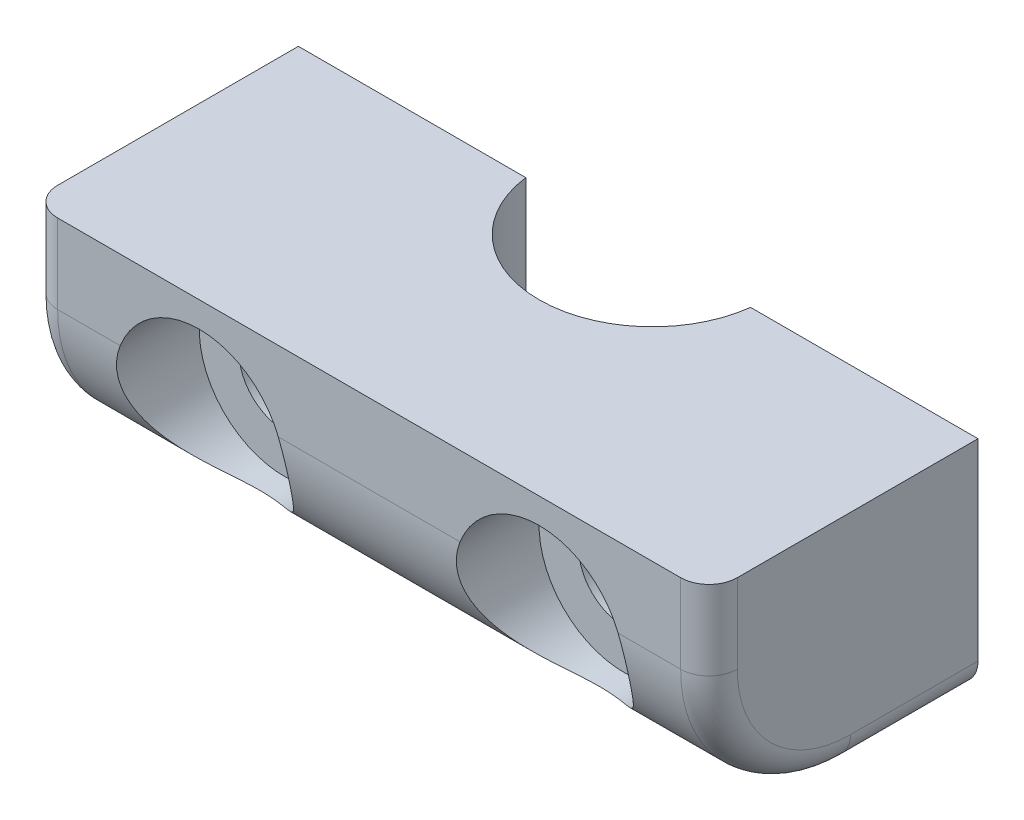
ISO-10303-21;
HEADER;
FILE_DESCRIPTION(('STEP AP214'),'2;1');
FILE_NAME('part.step','',(''),(''),'','','');
FILE_SCHEMA(('AUTOMOTIVE_DESIGN { 1 0 10303 214 1 1 1 1 }'));
ENDSEC;
DATA;
#1=APPLICATION_CONTEXT('core data for automotive mechanical design processes');
#2=APPLICATION_PROTOCOL_DEFINITION('international standard','automotive_design',2000,#1);
#3=PRODUCT_CONTEXT('',#1,'mechanical');
#4=PRODUCT('Part','Part','',(#3));
#5=PRODUCT_RELATED_PRODUCT_CATEGORY('part','',(#4));
#6=PRODUCT_DEFINITION_FORMATION('','',#4);
#7=PRODUCT_DEFINITION_CONTEXT('part definition',#1,'design');
#8=PRODUCT_DEFINITION('design','',#6,#7);
#9=PRODUCT_DEFINITION_SHAPE('','',#8);
#10=(LENGTH_UNIT() NAMED_UNIT(*) SI_UNIT(.MILLI.,.METRE.));
#11=(NAMED_UNIT(*) PLANE_ANGLE_UNIT() SI_UNIT($,.RADIAN.));
#12=(NAMED_UNIT(*) SI_UNIT($,.STERADIAN.) SOLID_ANGLE_UNIT());
#13=UNCERTAINTY_MEASURE_WITH_UNIT(LENGTH_MEASURE(1.E-05),#10,'distance_accuracy_value','');
#14=(GEOMETRIC_REPRESENTATION_CONTEXT(3) GLOBAL_UNCERTAINTY_ASSIGNED_CONTEXT((#13)) GLOBAL_UNIT_ASSIGNED_CONTEXT((#10,
#11,#12)) REPRESENTATION_CONTEXT('',''));
#15=CARTESIAN_POINT('',(0.,0.,0.));
#16=DIRECTION('',(0.,0.,1.));
#17=DIRECTION('',(1.,0.,0.));
#18=AXIS2_PLACEMENT_3D('',#15,#16,#17);
#19=CARTESIAN_POINT('',(18.,3.9,9.5));
#20=DIRECTION('',(0.,0.,-1.));
#21=DIRECTION('',(-1.,0.,0.));
#22=AXIS2_PLACEMENT_3D('',#19,#20,#21);
#23=CYLINDRICAL_SURFACE('',#22,1.6);
#24=CARTESIAN_POINT('',(18.,3.9,0.));
#25=DIRECTION('',(0.,0.,1.));
#26=DIRECTION('',(1.,0.,0.));
#27=AXIS2_PLACEMENT_3D('',#24,#25,#26);
#28=CIRCLE('',#27,1.6);
#29=CARTESIAN_POINT('',(19.6,3.9,0.));
#30=VERTEX_POINT('',#29);
#31=EDGE_CURVE('E151',#30,#30,#28,.T.);
#32=ORIENTED_EDGE('',*,*,#31,.F.);
#33=EDGE_LOOP('',(#32));
#34=FACE_BOUND('',#33,.T.);
#35=CARTESIAN_POINT('',(18.,3.9,6.5));
#36=DIRECTION('',(0.,0.,1.));
#37=DIRECTION('',(1.,0.,0.));
#38=AXIS2_PLACEMENT_3D('',#35,#36,#37);
#39=CIRCLE('',#38,1.6);
#40=CARTESIAN_POINT('',(19.6,3.9,6.5));
#41=VERTEX_POINT('',#40);
#42=EDGE_CURVE('E173',#41,#41,#39,.T.);
#43=ORIENTED_EDGE('',*,*,#42,.T.);
#44=EDGE_LOOP('',(#43));
#45=FACE_BOUND('',#44,.T.);
#46=ADVANCED_FACE('F33',(#34,#45),#23,.F.);
#47=CARTESIAN_POINT('',(6.,3.9,9.5));
#48=DIRECTION('',(0.,0.,-1.));
#49=DIRECTION('',(-1.,0.,0.));
#50=AXIS2_PLACEMENT_3D('',#47,#48,#49);
#51=CYLINDRICAL_SURFACE('',#50,1.6);
#52=CARTESIAN_POINT('',(6.,3.9,0.));
#53=DIRECTION('',(0.,0.,1.));
#54=DIRECTION('',(1.,0.,0.));
#55=AXIS2_PLACEMENT_3D('',#52,#53,#54);
#56=CIRCLE('',#55,1.6);
#57=CARTESIAN_POINT('',(7.6,3.9,0.));
#58=VERTEX_POINT('',#57);
#59=EDGE_CURVE('E244',#58,#58,#56,.T.);
#60=ORIENTED_EDGE('',*,*,#59,.F.);
#61=EDGE_LOOP('',(#60));
#62=FACE_BOUND('',#61,.T.);
#63=CARTESIAN_POINT('',(6.,3.9,6.5));
#64=DIRECTION('',(0.,0.,1.));
#65=DIRECTION('',(1.,0.,0.));
#66=AXIS2_PLACEMENT_3D('',#63,#64,#65);
#67=CIRCLE('',#66,1.6);
#68=CARTESIAN_POINT('',(7.6,3.9,6.5));
#69=VERTEX_POINT('',#68);
#70=EDGE_CURVE('E169',#69,#69,#67,.T.);
#71=ORIENTED_EDGE('',*,*,#70,.T.);
#72=EDGE_LOOP('',(#71));
#73=FACE_BOUND('',#72,.T.);
#74=ADVANCED_FACE('F211',(#62,#73),#51,.F.);
#75=CARTESIAN_POINT('',(0.,0.,0.));
#76=DIRECTION('',(0.,0.,-1.));
#77=DIRECTION('',(-1.,0.,0.));
#78=AXIS2_PLACEMENT_3D('',#75,#76,#77);
#79=PLANE('',#78);
#80=DIRECTION('',(0.,1.,0.));
#81=VECTOR('',#80,1.);
#82=CARTESIAN_POINT('',(24.,0.,0.));
#83=LINE('',#82,#81);
#84=CARTESIAN_POINT('',(24.,1.,0.));
#85=VERTEX_POINT('',#84);
#86=CARTESIAN_POINT('',(24.,7.8,0.));
#87=VERTEX_POINT('',#86);
#88=EDGE_CURVE('E162',#85,#87,#83,.T.);
#89=ORIENTED_EDGE('',*,*,#88,.F.);
#90=CARTESIAN_POINT('',(23.,1.,0.));
#91=DIRECTION('',(0.,0.,-1.));
#92=DIRECTION('',(-1.,0.,0.));
#93=AXIS2_PLACEMENT_3D('',#90,#91,#92);
#94=CIRCLE('',#93,1.);
#95=CARTESIAN_POINT('',(23.,0.,0.));
#96=VERTEX_POINT('',#95);
#97=EDGE_CURVE('E276',#85,#96,#94,.T.);
#98=ORIENTED_EDGE('',*,*,#97,.T.);
#99=DIRECTION('',(1.,0.,0.));
#100=VECTOR('',#99,1.);
#101=CARTESIAN_POINT('',(0.,0.,0.));
#102=LINE('',#101,#100);
#103=CARTESIAN_POINT('',(15.9686269665969,0.,0.));
#104=VERTEX_POINT('',#103);
#105=EDGE_CURVE('E150',#104,#96,#102,.T.);
#106=ORIENTED_EDGE('',*,*,#105,.F.);
#107=DIRECTION('',(0.,-1.,0.));
#108=VECTOR('',#107,1.);
#109=CARTESIAN_POINT('',(15.9686269665969,7.8,0.));
#110=LINE('',#109,#108);
#111=CARTESIAN_POINT('',(15.9686269665969,7.8,0.));
#112=VERTEX_POINT('',#111);
#113=EDGE_CURVE('E133',#112,#104,#110,.T.);
#114=ORIENTED_EDGE('',*,*,#113,.F.);
#115=DIRECTION('',(-1.,0.,0.));
#116=VECTOR('',#115,1.);
#117=CARTESIAN_POINT('',(0.,7.8,0.));
#118=LINE('',#117,#116);
#119=EDGE_CURVE('E148',#87,#112,#118,.T.);
#120=ORIENTED_EDGE('',*,*,#119,.F.);
#121=EDGE_LOOP('',(#89,#98,#106,#114,#120));
#122=FACE_BOUND('',#121,.T.);
#123=ORIENTED_EDGE('',*,*,#31,.T.);
#124=EDGE_LOOP('',(#123));
#125=FACE_BOUND('',#124,.T.);
#126=ADVANCED_FACE('F146',(#122,#125),#79,.T.);
#127=CARTESIAN_POINT('',(0.,0.,9.5));
#128=DIRECTION('',(0.,0.,-1.));
#129=DIRECTION('',(-1.,0.,0.));
#130=AXIS2_PLACEMENT_3D('',#127,#128,#129);
#131=PLANE('',#130);
#132=DIRECTION('',(-1.,0.,0.));
#133=VECTOR('',#132,1.);
#134=CARTESIAN_POINT('',(0.,7.8,9.5));
#135=LINE('',#134,#133);
#136=CARTESIAN_POINT('',(23.,7.8,9.5));
#137=VERTEX_POINT('',#136);
#138=CARTESIAN_POINT('',(1.,7.8,9.5));
#139=VERTEX_POINT('',#138);
#140=EDGE_CURVE('E157',#137,#139,#135,.T.);
#141=ORIENTED_EDGE('',*,*,#140,.T.);
#142=DIRECTION('',(0.,-1.,0.));
#143=VECTOR('',#142,1.);
#144=CARTESIAN_POINT('',(1.,0.,9.5));
#145=LINE('',#144,#143);
#146=CARTESIAN_POINT('',(1.,5.,9.5));
#147=VERTEX_POINT('',#146);
#148=EDGE_CURVE('E279',#139,#147,#145,.T.);
#149=ORIENTED_EDGE('',*,*,#148,.T.);
#150=DIRECTION('',(1.,0.,0.));
#151=VECTOR('',#150,1.);
#152=CARTESIAN_POINT('',(0.,5.,9.5));
#153=LINE('',#152,#151);
#154=CARTESIAN_POINT('',(3.20894285260943,5.,9.5));
#155=VERTEX_POINT('',#154);
#156=EDGE_CURVE('E181',#147,#155,#153,.T.);
#157=ORIENTED_EDGE('',*,*,#156,.T.);
#158=CARTESIAN_POINT('',(6.,3.9,9.5));
#159=DIRECTION('',(0.,0.,1.));
#160=DIRECTION('',(1.,0.,0.));
#161=AXIS2_PLACEMENT_3D('',#158,#159,#160);
#162=CIRCLE('',#161,3.);
#163=CARTESIAN_POINT('',(8.79105714739057,5.,9.5));
#164=VERTEX_POINT('',#163);
#165=EDGE_CURVE('E176',#164,#155,#162,.T.);
#166=ORIENTED_EDGE('',*,*,#165,.F.);
#167=DIRECTION('',(1.,0.,0.));
#168=VECTOR('',#167,1.);
#169=CARTESIAN_POINT('',(0.,5.,9.5));
#170=LINE('',#169,#168);
#171=CARTESIAN_POINT('',(15.2089428526094,5.,9.5));
#172=VERTEX_POINT('',#171);
#173=EDGE_CURVE('E179',#164,#172,#170,.T.);
#174=ORIENTED_EDGE('',*,*,#173,.T.);
#175=CARTESIAN_POINT('',(18.,3.9,9.5));
#176=DIRECTION('',(0.,0.,1.));
#177=DIRECTION('',(1.,0.,0.));
#178=AXIS2_PLACEMENT_3D('',#175,#176,#177);
#179=CIRCLE('',#178,3.);
#180=CARTESIAN_POINT('',(20.7910571473906,5.,9.5));
#181=VERTEX_POINT('',#180);
#182=EDGE_CURVE('E284',#181,#172,#179,.T.);
#183=ORIENTED_EDGE('',*,*,#182,.F.);
#184=DIRECTION('',(1.,0.,0.));
#185=VECTOR('',#184,1.);
#186=CARTESIAN_POINT('',(0.,5.,9.5));
#187=LINE('',#186,#185);
#188=CARTESIAN_POINT('',(23.,5.,9.5));
#189=VERTEX_POINT('',#188);
#190=EDGE_CURVE('E168',#181,#189,#187,.T.);
#191=ORIENTED_EDGE('',*,*,#190,.T.);
#192=DIRECTION('',(0.,1.,0.));
#193=VECTOR('',#192,1.);
#194=CARTESIAN_POINT('',(23.,0.,9.5));
#195=LINE('',#194,#193);
#196=EDGE_CURVE('E55',#189,#137,#195,.T.);
#197=ORIENTED_EDGE('',*,*,#196,.T.);
#198=EDGE_LOOP('',(#141,#149,#157,#166,#174,#183,#191,#197));
#199=FACE_BOUND('',#198,.T.);
#200=ADVANCED_FACE('F216',(#199),#131,.F.);
#201=CARTESIAN_POINT('',(1.,0.,0.));
#202=VERTEX_POINT('',#201);
#203=CARTESIAN_POINT('',(8.03137303340312,0.,0.));
#204=VERTEX_POINT('',#203);
#205=EDGE_CURVE('E298',#202,#204,#102,.T.);
#206=ORIENTED_EDGE('',*,*,#205,.F.);
#207=CARTESIAN_POINT('',(1.,1.,0.));
#208=DIRECTION('',(0.,0.,-1.));
#209=DIRECTION('',(-1.,0.,0.));
#210=AXIS2_PLACEMENT_3D('',#207,#208,#209);
#211=CIRCLE('',#210,1.);
#212=CARTESIAN_POINT('',(0.,1.,0.));
#213=VERTEX_POINT('',#212);
#214=EDGE_CURVE('E250',#202,#213,#211,.T.);
#215=ORIENTED_EDGE('',*,*,#214,.T.);
#216=DIRECTION('',(0.,-1.,0.));
#217=VECTOR('',#216,1.);
#218=CARTESIAN_POINT('',(0.,0.,0.));
#219=LINE('',#218,#217);
#220=CARTESIAN_POINT('',(0.,7.8,0.));
#221=VERTEX_POINT('',#220);
#222=EDGE_CURVE('E239',#221,#213,#219,.T.);
#223=ORIENTED_EDGE('',*,*,#222,.F.);
#224=CARTESIAN_POINT('',(8.03137303340312,7.8,0.));
#225=VERTEX_POINT('',#224);
#226=EDGE_CURVE('E158',#225,#221,#118,.T.);
#227=ORIENTED_EDGE('',*,*,#226,.F.);
#228=DIRECTION('',(0.,-1.,0.));
#229=VECTOR('',#228,1.);
#230=CARTESIAN_POINT('',(8.03137303340312,7.8,0.));
#231=LINE('',#230,#229);
#232=EDGE_CURVE('E136',#204,#225,#231,.F.);
#233=ORIENTED_EDGE('',*,*,#232,.F.);
#234=EDGE_LOOP('',(#206,#215,#223,#227,#233));
#235=FACE_BOUND('',#234,.T.);
#236=ORIENTED_EDGE('',*,*,#59,.T.);
#237=EDGE_LOOP('',(#236));
#238=FACE_BOUND('',#237,.T.);
#239=ADVANCED_FACE('F219',(#235,#238),#79,.T.);
#240=CARTESIAN_POINT('',(0.,0.,9.5));
#241=DIRECTION('',(1.,0.,0.));
#242=DIRECTION('',(0.,0.,-1.));
#243=AXIS2_PLACEMENT_3D('',#240,#241,#242);
#244=PLANE('',#243);
#245=ORIENTED_EDGE('',*,*,#222,.T.);
#246=DIRECTION('',(0.,0.,-1.));
#247=VECTOR('',#246,1.);
#248=CARTESIAN_POINT('',(0.,1.,9.5));
#249=LINE('',#248,#247);
#250=CARTESIAN_POINT('',(0.,1.,4.5));
#251=VERTEX_POINT('',#250);
#252=EDGE_CURVE('E242',#213,#251,#249,.F.);
#253=ORIENTED_EDGE('',*,*,#252,.T.);
#254=CARTESIAN_POINT('',(0.,5.,4.5));
#255=DIRECTION('',(1.,0.,0.));
#256=DIRECTION('',(0.,0.,-1.));
#257=AXIS2_PLACEMENT_3D('',#254,#255,#256);
#258=CIRCLE('',#257,4.);
#259=CARTESIAN_POINT('',(0.,5.,8.5));
#260=VERTEX_POINT('',#259);
#261=EDGE_CURVE('E255',#251,#260,#258,.F.);
#262=ORIENTED_EDGE('',*,*,#261,.T.);
#263=DIRECTION('',(0.,-1.,0.));
#264=VECTOR('',#263,1.);
#265=CARTESIAN_POINT('',(0.,0.,8.5));
#266=LINE('',#265,#264);
#267=CARTESIAN_POINT('',(0.,7.8,8.5));
#268=VERTEX_POINT('',#267);
#269=EDGE_CURVE('E259',#260,#268,#266,.F.);
#270=ORIENTED_EDGE('',*,*,#269,.T.);
#271=DIRECTION('',(0.,0.,-1.));
#272=VECTOR('',#271,1.);
#273=CARTESIAN_POINT('',(0.,7.8,9.5));
#274=LINE('',#273,#272);
#275=EDGE_CURVE('E160',#268,#221,#274,.T.);
#276=ORIENTED_EDGE('',*,*,#275,.T.);
#277=EDGE_LOOP('',(#245,#253,#262,#270,#276));
#278=FACE_BOUND('',#277,.T.);
#279=ADVANCED_FACE('F222',(#278),#244,.F.);
#280=CARTESIAN_POINT('',(0.,0.,9.5));
#281=DIRECTION('',(0.,1.,0.));
#282=DIRECTION('',(0.,0.,1.));
#283=AXIS2_PLACEMENT_3D('',#280,#281,#282);
#284=PLANE('',#283);
#285=DIRECTION('',(1.,0.,0.));
#286=VECTOR('',#285,1.);
#287=CARTESIAN_POINT('',(0.,0.,4.5));
#288=LINE('',#287,#286);
#289=CARTESIAN_POINT('',(23.,0.,4.5));
#290=VERTEX_POINT('',#289);
#291=CARTESIAN_POINT('',(1.,0.,4.5));
#292=VERTEX_POINT('',#291);
#293=EDGE_CURVE('E328',#290,#292,#288,.F.);
#294=ORIENTED_EDGE('',*,*,#293,.T.);
#295=DIRECTION('',(0.,0.,-1.));
#296=VECTOR('',#295,1.);
#297=CARTESIAN_POINT('',(1.,0.,9.5));
#298=LINE('',#297,#296);
#299=EDGE_CURVE('E266',#292,#202,#298,.T.);
#300=ORIENTED_EDGE('',*,*,#299,.T.);
#301=ORIENTED_EDGE('',*,*,#205,.T.);
#302=CARTESIAN_POINT('',(12.,0.,-0.5));
#303=DIRECTION('',(0.,-1.,0.));
#304=DIRECTION('',(0.,0.,-1.));
#305=AXIS2_PLACEMENT_3D('',#302,#303,#304);
#306=CIRCLE('',#305,4.);
#307=EDGE_CURVE('E140',#104,#204,#306,.T.);
#308=ORIENTED_EDGE('',*,*,#307,.F.);
#309=ORIENTED_EDGE('',*,*,#105,.T.);
#310=DIRECTION('',(0.,0.,-1.));
#311=VECTOR('',#310,1.);
#312=CARTESIAN_POINT('',(23.,0.,9.5));
#313=LINE('',#312,#311);
#314=EDGE_CURVE('E264',#96,#290,#313,.F.);
#315=ORIENTED_EDGE('',*,*,#314,.T.);
#316=EDGE_LOOP('',(#294,#300,#301,#308,#309,#315));
#317=FACE_BOUND('',#316,.T.);
#318=ADVANCED_FACE('F229',(#317),#284,.F.);
#319=CARTESIAN_POINT('',(24.,0.,9.5));
#320=DIRECTION('',(-1.,0.,0.));
#321=DIRECTION('',(0.,0.,1.));
#322=AXIS2_PLACEMENT_3D('',#319,#320,#321);
#323=PLANE('',#322);
#324=CARTESIAN_POINT('',(24.,5.,4.5));
#325=DIRECTION('',(-1.,0.,0.));
#326=DIRECTION('',(0.,0.,1.));
#327=AXIS2_PLACEMENT_3D('',#324,#325,#326);
#328=CIRCLE('',#327,4.);
#329=CARTESIAN_POINT('',(24.,5.,8.5));
#330=VERTEX_POINT('',#329);
#331=CARTESIAN_POINT('',(24.,1.,4.5));
#332=VERTEX_POINT('',#331);
#333=EDGE_CURVE('E271',#330,#332,#328,.F.);
#334=ORIENTED_EDGE('',*,*,#333,.T.);
#335=DIRECTION('',(0.,0.,-1.));
#336=VECTOR('',#335,1.);
#337=CARTESIAN_POINT('',(24.,1.,9.5));
#338=LINE('',#337,#336);
#339=EDGE_CURVE('E274',#332,#85,#338,.T.);
#340=ORIENTED_EDGE('',*,*,#339,.T.);
#341=ORIENTED_EDGE('',*,*,#88,.T.);
#342=DIRECTION('',(0.,0.,-1.));
#343=VECTOR('',#342,1.);
#344=CARTESIAN_POINT('',(24.,7.8,9.5));
#345=LINE('',#344,#343);
#346=CARTESIAN_POINT('',(24.,7.8,8.5));
#347=VERTEX_POINT('',#346);
#348=EDGE_CURVE('E155',#347,#87,#345,.T.);
#349=ORIENTED_EDGE('',*,*,#348,.F.);
#350=DIRECTION('',(0.,1.,0.));
#351=VECTOR('',#350,1.);
#352=CARTESIAN_POINT('',(24.,0.,8.5));
#353=LINE('',#352,#351);
#354=EDGE_CURVE('E269',#347,#330,#353,.F.);
#355=ORIENTED_EDGE('',*,*,#354,.T.);
#356=EDGE_LOOP('',(#334,#340,#341,#349,#355));
#357=FACE_BOUND('',#356,.T.);
#358=ADVANCED_FACE('F226',(#357),#323,.F.);
#359=CARTESIAN_POINT('',(0.,7.8,9.5));
#360=DIRECTION('',(0.,-1.,0.));
#361=DIRECTION('',(0.,0.,-1.));
#362=AXIS2_PLACEMENT_3D('',#359,#360,#361);
#363=PLANE('',#362);
#364=ORIENTED_EDGE('',*,*,#275,.F.);
#365=CARTESIAN_POINT('',(1.,7.8,8.5));
#366=DIRECTION('',(0.,-1.,0.));
#367=DIRECTION('',(0.,0.,-1.));
#368=AXIS2_PLACEMENT_3D('',#365,#366,#367);
#369=CIRCLE('',#368,1.);
#370=EDGE_CURVE('E11',#268,#139,#369,.F.);
#371=ORIENTED_EDGE('',*,*,#370,.T.);
#372=ORIENTED_EDGE('',*,*,#140,.F.);
#373=CARTESIAN_POINT('',(23.,7.8,8.5));
#374=DIRECTION('',(0.,-1.,0.));
#375=DIRECTION('',(0.,0.,-1.));
#376=AXIS2_PLACEMENT_3D('',#373,#374,#375);
#377=CIRCLE('',#376,1.);
#378=EDGE_CURVE('E42',#137,#347,#377,.F.);
#379=ORIENTED_EDGE('',*,*,#378,.T.);
#380=ORIENTED_EDGE('',*,*,#348,.T.);
#381=ORIENTED_EDGE('',*,*,#119,.T.);
#382=CARTESIAN_POINT('',(12.,7.8,-0.5));
#383=DIRECTION('',(0.,-1.,0.));
#384=DIRECTION('',(0.,0.,-1.));
#385=AXIS2_PLACEMENT_3D('',#382,#383,#384);
#386=CIRCLE('',#385,4.);
#387=EDGE_CURVE('E129',#112,#225,#386,.T.);
#388=ORIENTED_EDGE('',*,*,#387,.T.);
#389=ORIENTED_EDGE('',*,*,#226,.T.);
#390=EDGE_LOOP('',(#364,#371,#372,#379,#380,#381,#388,#389));
#391=FACE_BOUND('',#390,.T.);
#392=ADVANCED_FACE('F153',(#391),#363,.F.);
#393=CARTESIAN_POINT('',(12.,7.8,-0.5));
#394=DIRECTION('',(0.,-1.,0.));
#395=DIRECTION('',(0.,0.,-1.));
#396=AXIS2_PLACEMENT_3D('',#393,#394,#395);
#397=CYLINDRICAL_SURFACE('',#396,4.);
#398=ORIENTED_EDGE('',*,*,#113,.T.);
#399=ORIENTED_EDGE('',*,*,#307,.T.);
#400=ORIENTED_EDGE('',*,*,#232,.T.);
#401=ORIENTED_EDGE('',*,*,#387,.F.);
#402=EDGE_LOOP('',(#398,#399,#400,#401));
#403=FACE_BOUND('',#402,.T.);
#404=ADVANCED_FACE('F131',(#403),#397,.F.);
#405=CARTESIAN_POINT('',(6.,3.9,6.5));
#406=DIRECTION('',(0.,0.,1.));
#407=DIRECTION('',(1.,0.,0.));
#408=AXIS2_PLACEMENT_3D('',#405,#406,#407);
#409=CYLINDRICAL_SURFACE('',#408,3.);
#410=CARTESIAN_POINT('',(6.,3.9,6.5));
#411=DIRECTION('',(0.,0.,1.));
#412=DIRECTION('',(1.,0.,0.));
#413=AXIS2_PLACEMENT_3D('',#410,#411,#412);
#414=CIRCLE('',#413,3.);
#415=CARTESIAN_POINT('',(9.,3.9,6.5));
#416=VERTEX_POINT('',#415);
#417=EDGE_CURVE('E172',#416,#416,#414,.T.);
#418=ORIENTED_EDGE('',*,*,#417,.F.);
#419=EDGE_LOOP('',(#418));
#420=FACE_BOUND('',#419,.T.);
#421=ORIENTED_EDGE('',*,*,#165,.T.);
#422=CARTESIAN_POINT('',(3.20894285260943,5.,9.5));
#423=CARTESIAN_POINT('',(3.18153727815674,4.9304968475878,9.50001197749547));
#424=CARTESIAN_POINT('',(3.15674964688548,4.85995803268422,9.49855102103586));
#425=CARTESIAN_POINT('',(3.11252968664113,4.71735472650043,9.49251176033797));
#426=CARTESIAN_POINT('',(3.09309721156515,4.64529027690135,9.48793354115873));
#427=CARTESIAN_POINT('',(3.05976954992812,4.50045596933742,9.47551217697045));
#428=CARTESIAN_POINT('',(3.04585339748705,4.42768988025956,9.46768163019227));
#429=CARTESIAN_POINT('',(3.02347483209578,4.28177828886897,9.44869510691197));
#430=CARTESIAN_POINT('',(3.01501211639253,4.20863280784586,9.43753931506449));
#431=CARTESIAN_POINT('',(2.99776047686381,3.98938341052214,9.399038291881));
#432=CARTESIAN_POINT('',(2.99709704863184,3.84341790663943,9.36665535498872));
#433=CARTESIAN_POINT('',(3.01626846450861,3.55632269628723,9.28936096358357));
#434=CARTESIAN_POINT('',(3.03611342823244,3.41519541269644,9.24444333196599));
#435=CARTESIAN_POINT('',(3.09510371648633,3.13684437112184,9.14233399420083));
#436=CARTESIAN_POINT('',(3.134799261645,2.99985732336041,9.08482028543261));
#437=CARTESIAN_POINT('',(3.23125100840957,2.7365025772375,8.96069645684898));
#438=CARTESIAN_POINT('',(3.28801270125732,2.61013831365781,8.89408341298125));
#439=CARTESIAN_POINT('',(3.4269143557932,2.34934876233926,8.7426842157754));
#440=CARTESIAN_POINT('',(3.51169516357898,2.21702745602229,8.65671233732691));
#441=CARTESIAN_POINT('',(3.69880470453622,1.96901506162159,8.47949675826935));
#442=CARTESIAN_POINT('',(3.80116560271588,1.85335518387623,8.3882436014688));
#443=CARTESIAN_POINT('',(3.97794765036422,1.68192242480316,8.24133511933919));
#444=CARTESIAN_POINT('',(4.04731389944011,1.62061182225882,8.18593943729971));
#445=CARTESIAN_POINT('',(4.19182336801746,1.50435753493773,8.07587532600852));
#446=CARTESIAN_POINT('',(4.26696892898787,1.44941645359587,8.02120720215885));
#447=CARTESIAN_POINT('',(4.42295978761189,1.34624261931702,7.91402688372027));
#448=CARTESIAN_POINT('',(4.50379575778151,1.29799925662322,7.86151137441553));
#449=CARTESIAN_POINT('',(4.67143921455173,1.20854227542873,7.76027691962407));
#450=CARTESIAN_POINT('',(4.7582416396858,1.16732279923338,7.71155482914993));
#451=CARTESIAN_POINT('',(4.94671723614506,1.08895347419309,7.61574892297875));
#452=CARTESIAN_POINT('',(5.04901969239244,1.05256256876521,7.56926075600358));
#453=CARTESIAN_POINT('',(5.26100755585088,0.990355504645577,7.48754097024961));
#454=CARTESIAN_POINT('',(5.3706762917374,0.964516345821069,7.45228490564261));
#455=CARTESIAN_POINT('',(5.57956373974051,0.928006032417726,7.40167318379843));
#456=CARTESIAN_POINT('',(5.67794812360547,0.915663313817219,7.38415373063707));
#457=CARTESIAN_POINT('',(5.87692272580988,0.900871127819572,7.36309704023985));
#458=CARTESIAN_POINT('',(5.97751076181653,0.89841228123074,7.35954654738063));
#459=CARTESIAN_POINT('',(6.17784532737345,0.903599349001112,7.36696955678085));
#460=CARTESIAN_POINT('',(6.27759196749425,0.911243914144024,7.37794111975563));
#461=CARTESIAN_POINT('',(6.47362546700676,0.935969137025991,7.41274665652403));
#462=CARTESIAN_POINT('',(6.56990732122089,0.953062904633111,7.43659849941389));
#463=CARTESIAN_POINT('',(6.79952686344589,1.00514600768405,7.50729187389382));
#464=CARTESIAN_POINT('',(6.93008967271661,1.04472445758489,7.55964729752409));
#465=CARTESIAN_POINT('',(7.17980533119119,1.13848431717894,7.67716077302611));
#466=CARTESIAN_POINT('',(7.29892065295308,1.19271167431054,7.74235892984123));
#467=CARTESIAN_POINT('',(7.4975534797169,1.2987298734528,7.86234057998092));
#468=CARTESIAN_POINT('',(7.57951043330699,1.34772177505624,7.91563589050286));
#469=CARTESIAN_POINT('',(7.73749026279905,1.45252759201735,8.02436344871937));
#470=CARTESIAN_POINT('',(7.81351043007656,1.50834459183233,8.0797966547852));
#471=CARTESIAN_POINT('',(7.95971474014516,1.62659680019228,8.19144603968381));
#472=CARTESIAN_POINT('',(8.02989422296634,1.68903720455219,8.24766280271047));
#473=CARTESIAN_POINT('',(8.16425264062774,1.82037634508197,8.35972094809479));
#474=CARTESIAN_POINT('',(8.22843176754053,1.88927487438451,8.41556234241493));
#475=CARTESIAN_POINT('',(8.35156443353807,2.03469140457745,8.52684388527247));
#476=CARTESIAN_POINT('',(8.41040842019528,2.11132056060712,8.58226039778912));
#477=CARTESIAN_POINT('',(8.52111302059535,2.27106385553514,8.69073151281347));
#478=CARTESIAN_POINT('',(8.57297264885615,2.35417890697554,8.74378578130676));
#479=CARTESIAN_POINT('',(8.6689216499048,2.52648139794689,8.8464622464919));
#480=CARTESIAN_POINT('',(8.71302882533137,2.61565425519237,8.89609214320567));
#481=CARTESIAN_POINT('',(8.79278347637673,2.79980576866035,8.99108925484445));
#482=CARTESIAN_POINT('',(8.82843483334016,2.89478173589476,9.03645841970862));
#483=CARTESIAN_POINT('',(8.90349076852038,3.13127158936225,9.14012832629991));
#484=CARTESIAN_POINT('',(8.93813076669266,3.27551141152334,9.19580714952143));
#485=CARTESIAN_POINT('',(8.98576602003572,3.57188850917717,9.29424621167126));
#486=CARTESIAN_POINT('',(8.99876927211182,3.7240228454231,9.33701121873896));
#487=CARTESIAN_POINT('',(9.00049580880759,3.95517804772933,9.39026648283878));
#488=CARTESIAN_POINT('',(8.99807156982244,4.0329766413627,9.40623642173037));
#489=CARTESIAN_POINT('',(8.9870844547921,4.18881403224261,9.43439219680641));
#490=CARTESIAN_POINT('',(8.97852421299672,4.26685271210727,9.4465796536334));
#491=CARTESIAN_POINT('',(8.95521210203041,4.42240166898467,9.46714547562298));
#492=CARTESIAN_POINT('',(8.94046761418934,4.49991246435082,9.47552835705865));
#493=CARTESIAN_POINT('',(8.90482948408544,4.65378685246024,9.48859604809313));
#494=CARTESIAN_POINT('',(8.88393967589744,4.73015112938855,9.49328315679974));
#495=CARTESIAN_POINT('',(8.84966449319672,4.83840181236987,9.4974959976828));
#496=CARTESIAN_POINT('',(8.83871324032208,4.87102634159737,9.49844161799544));
#497=CARTESIAN_POINT('',(8.81570953904712,4.935837639213,9.49969313229313));
#498=CARTESIAN_POINT('',(8.80365890819201,4.96802503257531,9.50000006287961));
#499=CARTESIAN_POINT('',(8.79105714739057,5.,9.5));
#500=B_SPLINE_CURVE_WITH_KNOTS('',3,(#422,#423,#424,#425,#426,#427,#428,#429,#430,#431,#432,
#433,#434,#435,#436,#437,#438,#439,#440,#441,#442,#443,#444,#445,#446,#447,#448,#449,#450,#451,
#452,#453,#454,#455,#456,#457,#458,#459,#460,#461,#462,#463,#464,#465,#466,#467,#468,#469,#470,
#471,#472,#473,#474,#475,#476,#477,#478,#479,#480,#481,#482,#483,#484,#485,#486,#487,#488,#489,
#490,#491,#492,#493,#494,#495,#496,#497,#498,#499),.UNSPECIFIED.,.F.,.F.,(4,2,2,2,2,2,2,2,2,2,2,
2,2,2,2,2,2,2,2,2,2,2,2,2,2,2,2,2,2,2,2,2,2,2,2,2,2,2,4),(0.,0.224070333045722,
0.448134552252039,0.67133881249416,0.894530680258281,1.3407662993435,1.78722221311861,
2.24680253265572,2.70653088632574,3.24202939948294,3.7785183210453,4.10188056975071,
4.42537452482054,4.74835004370605,5.07105487900464,5.42442543223716,5.77702156206525,
6.07777554510364,6.37824406348611,6.67867246115762,6.97951872456207,7.41545975609391,
7.85278435414266,8.18044413952677,8.50825255487575,8.83632005259889,9.16437704521914,
9.49810685014278,9.8318836945965,10.1648837485443,10.4977306534843,10.9710326729724,
11.4441597219348,11.6822570631425,11.9202522478598,12.1579641734391,12.3955281035871,
12.4987861544365,12.6018764850447),.UNSPECIFIED.);
#501=EDGE_CURVE('E183',#155,#164,#500,.T.);
#502=ORIENTED_EDGE('',*,*,#501,.T.);
#503=EDGE_LOOP('',(#421,#502));
#504=FACE_BOUND('',#503,.T.);
#505=ADVANCED_FACE('F200',(#420,#504),#409,.F.);
#506=CARTESIAN_POINT('',(6.,3.9,6.5));
#507=DIRECTION('',(0.,0.,1.));
#508=DIRECTION('',(1.,0.,0.));
#509=AXIS2_PLACEMENT_3D('',#506,#507,#508);
#510=PLANE('',#509);
#511=ORIENTED_EDGE('',*,*,#70,.F.);
#512=EDGE_LOOP('',(#511));
#513=FACE_BOUND('',#512,.T.);
#514=ORIENTED_EDGE('',*,*,#417,.T.);
#515=EDGE_LOOP('',(#514));
#516=FACE_BOUND('',#515,.T.);
#517=ADVANCED_FACE('F205',(#513,#516),#510,.T.);
#518=CARTESIAN_POINT('',(18.,3.9,6.5));
#519=DIRECTION('',(0.,0.,1.));
#520=DIRECTION('',(1.,0.,0.));
#521=AXIS2_PLACEMENT_3D('',#518,#519,#520);
#522=CYLINDRICAL_SURFACE('',#521,3.);
#523=CARTESIAN_POINT('',(18.,3.9,6.5));
#524=DIRECTION('',(0.,0.,1.));
#525=DIRECTION('',(1.,0.,0.));
#526=AXIS2_PLACEMENT_3D('',#523,#524,#525);
#527=CIRCLE('',#526,3.);
#528=CARTESIAN_POINT('',(21.,3.9,6.5));
#529=VERTEX_POINT('',#528);
#530=EDGE_CURVE('E177',#529,#529,#527,.T.);
#531=ORIENTED_EDGE('',*,*,#530,.F.);
#532=EDGE_LOOP('',(#531));
#533=FACE_BOUND('',#532,.T.);
#534=ORIENTED_EDGE('',*,*,#182,.T.);
#535=CARTESIAN_POINT('',(15.2089428526094,5.,9.5));
#536=CARTESIAN_POINT('',(15.1815372781567,4.9304968475878,9.50001197749547));
#537=CARTESIAN_POINT('',(15.1567496468855,4.85995803268422,9.49855102103586));
#538=CARTESIAN_POINT('',(15.1125296866411,4.71735472650043,9.49251176033797));
#539=CARTESIAN_POINT('',(15.0930972115652,4.64529027690135,9.48793354115873));
#540=CARTESIAN_POINT('',(15.0597695499281,4.50045596933742,9.47551217697045));
#541=CARTESIAN_POINT('',(15.0458533974871,4.42768988025956,9.46768163019227));
#542=CARTESIAN_POINT('',(15.0234748320958,4.28177828886897,9.44869510691197));
#543=CARTESIAN_POINT('',(15.0150121163925,4.20863280784587,9.43753931506449));
#544=CARTESIAN_POINT('',(14.9977604768638,3.98938341052214,9.399038291881));
#545=CARTESIAN_POINT('',(14.9970970486318,3.84341790663943,9.36665535498872));
#546=CARTESIAN_POINT('',(15.0162684645086,3.55632269628723,9.28936096358357));
#547=CARTESIAN_POINT('',(15.0361134282324,3.41519541269644,9.24444333196599));
#548=CARTESIAN_POINT('',(15.0951037164863,3.13684437112184,9.14233399420083));
#549=CARTESIAN_POINT('',(15.134799261645,2.99985732336041,9.08482028543261));
#550=CARTESIAN_POINT('',(15.2312510084096,2.7365025772375,8.96069645684898));
#551=CARTESIAN_POINT('',(15.2880127012573,2.61013831365781,8.89408341298125));
#552=CARTESIAN_POINT('',(15.4269143557932,2.34934876233926,8.7426842157754));
#553=CARTESIAN_POINT('',(15.511695163579,2.21702745602229,8.65671233732691));
#554=CARTESIAN_POINT('',(15.6988047045362,1.96901506162159,8.47949675826935));
#555=CARTESIAN_POINT('',(15.8011656027159,1.85335518387623,8.3882436014688));
#556=CARTESIAN_POINT('',(15.9779476503642,1.68192242480316,8.24133511933919));
#557=CARTESIAN_POINT('',(16.0473138994401,1.62061182225882,8.18593943729971));
#558=CARTESIAN_POINT('',(16.1918233680175,1.50435753493773,8.07587532600853));
#559=CARTESIAN_POINT('',(16.2669689289879,1.44941645359588,8.02120720215885));
#560=CARTESIAN_POINT('',(16.4229597876119,1.34624261931703,7.91402688372027));
#561=CARTESIAN_POINT('',(16.5037957577815,1.29799925662322,7.86151137441553));
#562=CARTESIAN_POINT('',(16.6714392145517,1.20854227542873,7.76027691962407));
#563=CARTESIAN_POINT('',(16.7582416396858,1.16732279923338,7.71155482914993));
#564=CARTESIAN_POINT('',(16.9467172361451,1.0889534741931,7.61574892297875));
#565=CARTESIAN_POINT('',(17.0490196923924,1.05256256876521,7.56926075600359));
#566=CARTESIAN_POINT('',(17.2610075558509,0.990355504645578,7.48754097024961));
#567=CARTESIAN_POINT('',(17.3706762917374,0.964516345821071,7.45228490564261));
#568=CARTESIAN_POINT('',(17.5795637397405,0.928006032417728,7.40167318379843));
#569=CARTESIAN_POINT('',(17.6779481236055,0.915663313817221,7.38415373063708));
#570=CARTESIAN_POINT('',(17.8769227258099,0.900871127819574,7.36309704023985));
#571=CARTESIAN_POINT('',(17.9775107618165,0.898412281230741,7.35954654738063));
#572=CARTESIAN_POINT('',(18.1778453273735,0.903599349001114,7.36696955678086));
#573=CARTESIAN_POINT('',(18.2775919674943,0.911243914144027,7.37794111975563));
#574=CARTESIAN_POINT('',(18.4736254670068,0.935969137025994,7.41274665652403));
#575=CARTESIAN_POINT('',(18.5699073212209,0.953062904633115,7.43659849941389));
#576=CARTESIAN_POINT('',(18.7995268634459,1.00514600768405,7.50729187389382));
#577=CARTESIAN_POINT('',(18.9300896727166,1.04472445758489,7.5596472975241));
#578=CARTESIAN_POINT('',(19.1798053311912,1.13848431717895,7.67716077302612));
#579=CARTESIAN_POINT('',(19.2989206529531,1.19271167431055,7.74235892984124));
#580=CARTESIAN_POINT('',(19.4975534797169,1.29872987345281,7.86234057998093));
#581=CARTESIAN_POINT('',(19.579510433307,1.34772177505626,7.91563589050288));
#582=CARTESIAN_POINT('',(19.7374902627991,1.45252759201736,8.02436344871939));
#583=CARTESIAN_POINT('',(19.8135104300766,1.50834459183234,8.07979665478521));
#584=CARTESIAN_POINT('',(19.9597147401452,1.62659680019229,8.19144603968383));
#585=CARTESIAN_POINT('',(20.0298942229664,1.6890372045522,8.24766280271048));
#586=CARTESIAN_POINT('',(20.1642526406278,1.82037634508198,8.3597209480948));
#587=CARTESIAN_POINT('',(20.2284317675405,1.88927487438453,8.41556234241494));
#588=CARTESIAN_POINT('',(20.3515644335381,2.03469140457747,8.52684388527248));
#589=CARTESIAN_POINT('',(20.4104084201953,2.11132056060714,8.58226039778913));
#590=CARTESIAN_POINT('',(20.5211130205954,2.27106385553517,8.69073151281348));
#591=CARTESIAN_POINT('',(20.5729726488562,2.35417890697556,8.74378578130677));
#592=CARTESIAN_POINT('',(20.6689216499048,2.52648139794691,8.84646224649192));
#593=CARTESIAN_POINT('',(20.7130288253314,2.61565425519239,8.89609214320568));
#594=CARTESIAN_POINT('',(20.7927834763767,2.79980576866037,8.99108925484446));
#595=CARTESIAN_POINT('',(20.8284348333402,2.89478173589479,9.03645841970863));
#596=CARTESIAN_POINT('',(20.9034907685204,3.13127158936228,9.14012832629992));
#597=CARTESIAN_POINT('',(20.9381307666927,3.27551141152337,9.19580714952144));
#598=CARTESIAN_POINT('',(20.9857660200357,3.5718885091772,9.29424621167127));
#599=CARTESIAN_POINT('',(20.9987692721118,3.72402284542313,9.33701121873897));
#600=CARTESIAN_POINT('',(21.0004958088076,3.95517804772936,9.39026648283878));
#601=CARTESIAN_POINT('',(20.9980715698224,4.03297664136273,9.40623642173038));
#602=CARTESIAN_POINT('',(20.9870844547921,4.18881403224264,9.43439219680642));
#603=CARTESIAN_POINT('',(20.9785242129967,4.2668527121073,9.4465796536334));
#604=CARTESIAN_POINT('',(20.9552121020304,4.4224016689847,9.46714547562299));
#605=CARTESIAN_POINT('',(20.9404676141893,4.49991246435085,9.47552835705866));
#606=CARTESIAN_POINT('',(20.9048294840854,4.65378685246026,9.48859604809313));
#607=CARTESIAN_POINT('',(20.8839396758974,4.73015112938857,9.49328315679974));
#608=CARTESIAN_POINT('',(20.8496644931967,4.83840181236989,9.4974959976828));
#609=CARTESIAN_POINT('',(20.8387132403221,4.87102634159738,9.49844161799544));
#610=CARTESIAN_POINT('',(20.8157095390471,4.93583763921301,9.49969313229312));
#611=CARTESIAN_POINT('',(20.803658908192,4.96802503257531,9.50000006287961));
#612=CARTESIAN_POINT('',(20.7910571473906,5.,9.5));
#613=B_SPLINE_CURVE_WITH_KNOTS('',3,(#535,#536,#537,#538,#539,#540,#541,#542,#543,#544,#545,
#546,#547,#548,#549,#550,#551,#552,#553,#554,#555,#556,#557,#558,#559,#560,#561,#562,#563,#564,
#565,#566,#567,#568,#569,#570,#571,#572,#573,#574,#575,#576,#577,#578,#579,#580,#581,#582,#583,
#584,#585,#586,#587,#588,#589,#590,#591,#592,#593,#594,#595,#596,#597,#598,#599,#600,#601,#602,
#603,#604,#605,#606,#607,#608,#609,#610,#611,#612),.UNSPECIFIED.,.F.,.F.,(4,2,2,2,2,2,2,2,2,2,2,
2,2,2,2,2,2,2,2,2,2,2,2,2,2,2,2,2,2,2,2,2,2,2,2,2,2,2,4),(0.,0.224070333045722,0.44813455225204,
0.671338812494159,0.89453068025828,1.3407662993435,1.78722221311861,2.24680253265572,
2.70653088632574,3.24202939948294,3.7785183210453,4.10188056975071,4.42537452482054,
4.74835004370604,5.07105487900464,5.42442543223716,5.77702156206525,6.07777554510364,
6.37824406348611,6.67867246115762,6.97951872456208,7.41545975609393,7.85278435414268,
8.18044413952679,8.50825255487577,8.83632005259891,9.16437704521916,9.4981068501428,
9.83188369459653,10.1648837485443,10.4977306534843,10.9710326729724,11.4441597219348,
11.6822570631425,11.9202522478598,12.1579641734391,12.3955281035871,12.4987861544365,
12.6018764850447),.UNSPECIFIED.);
#614=EDGE_CURVE('E190',#172,#181,#613,.T.);
#615=ORIENTED_EDGE('',*,*,#614,.T.);
#616=EDGE_LOOP('',(#534,#615));
#617=FACE_BOUND('',#616,.T.);
#618=ADVANCED_FACE('F318',(#533,#617),#522,.F.);
#619=CARTESIAN_POINT('',(18.,3.9,6.5));
#620=DIRECTION('',(0.,0.,1.));
#621=DIRECTION('',(1.,0.,0.));
#622=AXIS2_PLACEMENT_3D('',#619,#620,#621);
#623=PLANE('',#622);
#624=ORIENTED_EDGE('',*,*,#42,.F.);
#625=EDGE_LOOP('',(#624));
#626=FACE_BOUND('',#625,.T.);
#627=ORIENTED_EDGE('',*,*,#530,.T.);
#628=EDGE_LOOP('',(#627));
#629=FACE_BOUND('',#628,.T.);
#630=ADVANCED_FACE('F316',(#626,#629),#623,.T.);
#631=CARTESIAN_POINT('',(0.,5.,4.5));
#632=DIRECTION('',(1.,0.,0.));
#633=DIRECTION('',(0.,0.,-1.));
#634=AXIS2_PLACEMENT_3D('',#631,#632,#633);
#635=CYLINDRICAL_SURFACE('',#634,5.);
#636=ORIENTED_EDGE('',*,*,#156,.F.);
#637=CARTESIAN_POINT('',(1.,5.,4.5));
#638=DIRECTION('',(1.,0.,0.));
#639=DIRECTION('',(0.,0.,-1.));
#640=AXIS2_PLACEMENT_3D('',#637,#638,#639);
#641=CIRCLE('',#640,5.);
#642=EDGE_CURVE('E257',#147,#292,#641,.T.);
#643=ORIENTED_EDGE('',*,*,#642,.T.);
#644=ORIENTED_EDGE('',*,*,#293,.F.);
#645=CARTESIAN_POINT('',(23.,5.,4.5));
#646=DIRECTION('',(-1.,0.,0.));
#647=DIRECTION('',(0.,0.,1.));
#648=AXIS2_PLACEMENT_3D('',#645,#646,#647);
#649=CIRCLE('',#648,5.);
#650=EDGE_CURVE('E254',#290,#189,#649,.T.);
#651=ORIENTED_EDGE('',*,*,#650,.T.);
#652=ORIENTED_EDGE('',*,*,#190,.F.);
#653=ORIENTED_EDGE('',*,*,#614,.F.);
#654=ORIENTED_EDGE('',*,*,#173,.F.);
#655=ORIENTED_EDGE('',*,*,#501,.F.);
#656=EDGE_LOOP('',(#636,#643,#644,#651,#652,#653,#654,#655));
#657=FACE_BOUND('',#656,.T.);
#658=ADVANCED_FACE('F196',(#657),#635,.T.);
#659=CARTESIAN_POINT('',(1.,1.,9.5));
#660=DIRECTION('',(0.,0.,-1.));
#661=DIRECTION('',(-1.,0.,0.));
#662=AXIS2_PLACEMENT_3D('',#659,#660,#661);
#663=CYLINDRICAL_SURFACE('',#662,1.);
#664=ORIENTED_EDGE('',*,*,#214,.F.);
#665=ORIENTED_EDGE('',*,*,#299,.F.);
#666=CARTESIAN_POINT('',(1.,1.,4.5));
#667=DIRECTION('',(0.,0.,1.));
#668=DIRECTION('',(1.,0.,0.));
#669=AXIS2_PLACEMENT_3D('',#666,#667,#668);
#670=CIRCLE('',#669,1.);
#671=EDGE_CURVE('E252',#251,#292,#670,.T.);
#672=ORIENTED_EDGE('',*,*,#671,.F.);
#673=ORIENTED_EDGE('',*,*,#252,.F.);
#674=EDGE_LOOP('',(#664,#665,#672,#673));
#675=FACE_BOUND('',#674,.T.);
#676=ADVANCED_FACE('F248',(#675),#663,.T.);
#677=CARTESIAN_POINT('',(1.,0.,8.5));
#678=DIRECTION('',(0.,-1.,0.));
#679=DIRECTION('',(0.,0.,-1.));
#680=AXIS2_PLACEMENT_3D('',#677,#678,#679);
#681=CYLINDRICAL_SURFACE('',#680,1.);
#682=ORIENTED_EDGE('',*,*,#370,.F.);
#683=ORIENTED_EDGE('',*,*,#269,.F.);
#684=CARTESIAN_POINT('',(1.,5.,8.5));
#685=DIRECTION('',(0.,-1.,0.));
#686=DIRECTION('',(0.,0.,-1.));
#687=AXIS2_PLACEMENT_3D('',#684,#685,#686);
#688=CIRCLE('',#687,1.);
#689=EDGE_CURVE('E282',#147,#260,#688,.T.);
#690=ORIENTED_EDGE('',*,*,#689,.F.);
#691=ORIENTED_EDGE('',*,*,#148,.F.);
#692=EDGE_LOOP('',(#682,#683,#690,#691));
#693=FACE_BOUND('',#692,.T.);
#694=ADVANCED_FACE('F335',(#693),#681,.T.);
#695=CARTESIAN_POINT('',(1.,5.,4.5));
#696=DIRECTION('',(1.,0.,0.));
#697=DIRECTION('',(0.,0.,-1.));
#698=AXIS2_PLACEMENT_3D('',#695,#696,#697);
#699=TOROIDAL_SURFACE('',#698,4.,1.);
#700=ORIENTED_EDGE('',*,*,#671,.T.);
#701=ORIENTED_EDGE('',*,*,#642,.F.);
#702=ORIENTED_EDGE('',*,*,#689,.T.);
#703=ORIENTED_EDGE('',*,*,#261,.F.);
#704=EDGE_LOOP('',(#700,#701,#702,#703));
#705=FACE_BOUND('',#704,.T.);
#706=ADVANCED_FACE('F339',(#705),#699,.T.);
#707=CARTESIAN_POINT('',(23.,0.,8.5));
#708=DIRECTION('',(0.,1.,0.));
#709=DIRECTION('',(0.,0.,1.));
#710=AXIS2_PLACEMENT_3D('',#707,#708,#709);
#711=CYLINDRICAL_SURFACE('',#710,1.);
#712=ORIENTED_EDGE('',*,*,#378,.F.);
#713=ORIENTED_EDGE('',*,*,#196,.F.);
#714=CARTESIAN_POINT('',(23.,5.,8.5));
#715=DIRECTION('',(0.,-1.,0.));
#716=DIRECTION('',(0.,0.,-1.));
#717=AXIS2_PLACEMENT_3D('',#714,#715,#716);
#718=CIRCLE('',#717,1.);
#719=EDGE_CURVE('E37',#330,#189,#718,.T.);
#720=ORIENTED_EDGE('',*,*,#719,.F.);
#721=ORIENTED_EDGE('',*,*,#354,.F.);
#722=EDGE_LOOP('',(#712,#713,#720,#721));
#723=FACE_BOUND('',#722,.T.);
#724=ADVANCED_FACE('F35',(#723),#711,.T.);
#725=CARTESIAN_POINT('',(23.,1.,9.5));
#726=DIRECTION('',(0.,0.,-1.));
#727=DIRECTION('',(-1.,0.,0.));
#728=AXIS2_PLACEMENT_3D('',#725,#726,#727);
#729=CYLINDRICAL_SURFACE('',#728,1.);
#730=ORIENTED_EDGE('',*,*,#97,.F.);
#731=ORIENTED_EDGE('',*,*,#339,.F.);
#732=CARTESIAN_POINT('',(23.,1.,4.5));
#733=DIRECTION('',(0.,0.,1.));
#734=DIRECTION('',(1.,0.,0.));
#735=AXIS2_PLACEMENT_3D('',#732,#733,#734);
#736=CIRCLE('',#735,1.);
#737=EDGE_CURVE('E285',#290,#332,#736,.T.);
#738=ORIENTED_EDGE('',*,*,#737,.F.);
#739=ORIENTED_EDGE('',*,*,#314,.F.);
#740=EDGE_LOOP('',(#730,#731,#738,#739));
#741=FACE_BOUND('',#740,.T.);
#742=ADVANCED_FACE('F345',(#741),#729,.T.);
#743=CARTESIAN_POINT('',(23.,5.,4.5));
#744=DIRECTION('',(-1.,0.,0.));
#745=DIRECTION('',(0.,0.,1.));
#746=AXIS2_PLACEMENT_3D('',#743,#744,#745);
#747=TOROIDAL_SURFACE('',#746,4.,1.);
#748=ORIENTED_EDGE('',*,*,#719,.T.);
#749=ORIENTED_EDGE('',*,*,#650,.F.);
#750=ORIENTED_EDGE('',*,*,#737,.T.);
#751=ORIENTED_EDGE('',*,*,#333,.F.);
#752=EDGE_LOOP('',(#748,#749,#750,#751));
#753=FACE_BOUND('',#752,.T.);
#754=ADVANCED_FACE('F293',(#753),#747,.T.);
#755=CLOSED_SHELL('',(#46,#74,#126,#200,#239,#279,#318,#358,#392,#404,#505,#517,#618,#630,#658,
#676,#694,#706,#724,#742,#754));
#756=MANIFOLD_SOLID_BREP('B2',#755);
#757=ADVANCED_BREP_SHAPE_REPRESENTATION('',(#18,#756),#14);
#758=SHAPE_DEFINITION_REPRESENTATION(#9,#757);
ENDSEC;
END-ISO-10303-21;
